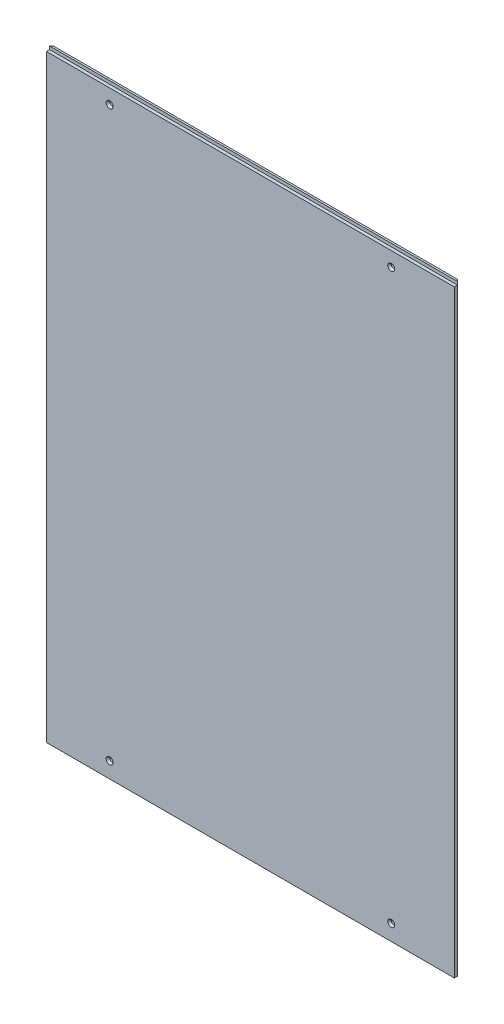
ISO-10303-21;
HEADER;
FILE_DESCRIPTION(('STEP AP214'),'2;1');
FILE_NAME('part.step','',(''),(''),'','','');
FILE_SCHEMA(('AUTOMOTIVE_DESIGN { 1 0 10303 214 1 1 1 1 }'));
ENDSEC;
DATA;
#1=APPLICATION_CONTEXT('core data for automotive mechanical design processes');
#2=APPLICATION_PROTOCOL_DEFINITION('international standard','automotive_design',2000,#1);
#3=PRODUCT_CONTEXT('',#1,'mechanical');
#4=PRODUCT('Part','Part','',(#3));
#5=PRODUCT_RELATED_PRODUCT_CATEGORY('part','',(#4));
#6=PRODUCT_DEFINITION_FORMATION('','',#4);
#7=PRODUCT_DEFINITION_CONTEXT('part definition',#1,'design');
#8=PRODUCT_DEFINITION('design','',#6,#7);
#9=PRODUCT_DEFINITION_SHAPE('','',#8);
#10=(LENGTH_UNIT() NAMED_UNIT(*) SI_UNIT(.MILLI.,.METRE.));
#11=(NAMED_UNIT(*) PLANE_ANGLE_UNIT() SI_UNIT($,.RADIAN.));
#12=(NAMED_UNIT(*) SI_UNIT($,.STERADIAN.) SOLID_ANGLE_UNIT());
#13=UNCERTAINTY_MEASURE_WITH_UNIT(LENGTH_MEASURE(1.E-05),#10,'distance_accuracy_value','');
#14=(GEOMETRIC_REPRESENTATION_CONTEXT(3) GLOBAL_UNCERTAINTY_ASSIGNED_CONTEXT((#13)) GLOBAL_UNIT_ASSIGNED_CONTEXT((#10,
#11,#12)) REPRESENTATION_CONTEXT('',''));
#15=CARTESIAN_POINT('',(0.,0.,0.));
#16=DIRECTION('',(0.,0.,1.));
#17=DIRECTION('',(1.,0.,0.));
#18=AXIS2_PLACEMENT_3D('',#15,#16,#17);
#19=CARTESIAN_POINT('',(-323.,476.5,8.));
#20=DIRECTION('',(0.,-1.,0.));
#21=DIRECTION('',(0.,0.,-1.));
#22=AXIS2_PLACEMENT_3D('',#19,#20,#21);
#23=PLANE('',#22);
#24=DIRECTION('',(-1.,0.,0.));
#25=VECTOR('',#24,1.);
#26=CARTESIAN_POINT('',(323.,476.5,3.));
#27=LINE('',#26,#25);
#28=CARTESIAN_POINT('',(323.,476.5,3.));
#29=VERTEX_POINT('',#28);
#30=CARTESIAN_POINT('',(-323.,476.5,3.));
#31=VERTEX_POINT('',#30);
#32=EDGE_CURVE('E107',#29,#31,#27,.T.);
#33=ORIENTED_EDGE('',*,*,#32,.F.);
#34=DIRECTION('',(-0.707106781186548,0.,-0.707106781186548));
#35=VECTOR('',#34,1.);
#36=CARTESIAN_POINT('',(323.,476.5,2.99999999999989));
#37=LINE('',#36,#35);
#38=CARTESIAN_POINT('',(320.,476.5,0.));
#39=VERTEX_POINT('',#38);
#40=EDGE_CURVE('E135',#29,#39,#37,.T.);
#41=ORIENTED_EDGE('',*,*,#40,.T.);
#42=DIRECTION('',(-1.,0.,0.));
#43=VECTOR('',#42,1.);
#44=CARTESIAN_POINT('',(-323.,476.5,0.));
#45=LINE('',#44,#43);
#46=CARTESIAN_POINT('',(-320.,476.5,0.));
#47=VERTEX_POINT('',#46);
#48=EDGE_CURVE('E221',#39,#47,#45,.T.);
#49=ORIENTED_EDGE('',*,*,#48,.T.);
#50=DIRECTION('',(-0.707106781186548,0.,0.707106781186548));
#51=VECTOR('',#50,1.);
#52=CARTESIAN_POINT('',(-323.,476.5,2.99999999999989));
#53=LINE('',#52,#51);
#54=EDGE_CURVE('E137',#47,#31,#53,.T.);
#55=ORIENTED_EDGE('',*,*,#54,.T.);
#56=EDGE_LOOP('',(#33,#41,#49,#55));
#57=FACE_BOUND('',#56,.T.);
#58=ADVANCED_FACE('F34',(#57),#23,.F.);
#59=CARTESIAN_POINT('',(323.,-476.5,8.));
#60=DIRECTION('',(-1.,0.,0.));
#61=DIRECTION('',(0.,0.,1.));
#62=AXIS2_PLACEMENT_3D('',#59,#60,#61);
#63=PLANE('',#62);
#64=DIRECTION('',(0.,1.,0.));
#65=VECTOR('',#64,1.);
#66=CARTESIAN_POINT('',(323.,476.5,2.99999999999989));
#67=LINE('',#66,#65);
#68=CARTESIAN_POINT('',(323.,-476.5,2.99999999999989));
#69=VERTEX_POINT('',#68);
#70=CARTESIAN_POINT('',(323.,471.5,2.99999999999989));
#71=VERTEX_POINT('',#70);
#72=EDGE_CURVE('E139',#69,#71,#67,.T.);
#73=ORIENTED_EDGE('',*,*,#72,.T.);
#74=DIRECTION('',(0.,0.,1.));
#75=VECTOR('',#74,1.);
#76=CARTESIAN_POINT('',(323.,471.5,3.));
#77=LINE('',#76,#75);
#78=CARTESIAN_POINT('',(323.,471.5,8.));
#79=VERTEX_POINT('',#78);
#80=EDGE_CURVE('E98',#71,#79,#77,.T.);
#81=ORIENTED_EDGE('',*,*,#80,.T.);
#82=DIRECTION('',(0.,1.,0.));
#83=VECTOR('',#82,1.);
#84=CARTESIAN_POINT('',(323.,-476.5,8.));
#85=LINE('',#84,#83);
#86=CARTESIAN_POINT('',(323.,-476.5,8.));
#87=VERTEX_POINT('',#86);
#88=EDGE_CURVE('E228',#87,#79,#85,.T.);
#89=ORIENTED_EDGE('',*,*,#88,.F.);
#90=DIRECTION('',(0.,0.,-1.));
#91=VECTOR('',#90,1.);
#92=CARTESIAN_POINT('',(323.,-476.5,8.));
#93=LINE('',#92,#91);
#94=EDGE_CURVE('E126',#87,#69,#93,.T.);
#95=ORIENTED_EDGE('',*,*,#94,.T.);
#96=EDGE_LOOP('',(#73,#81,#89,#95));
#97=FACE_BOUND('',#96,.T.);
#98=ADVANCED_FACE('F179',(#97),#63,.F.);
#99=CARTESIAN_POINT('',(-323.,-476.5,8.));
#100=DIRECTION('',(1.,0.,0.));
#101=DIRECTION('',(0.,0.,-1.));
#102=AXIS2_PLACEMENT_3D('',#99,#100,#101);
#103=PLANE('',#102);
#104=DIRECTION('',(0.,-1.,0.));
#105=VECTOR('',#104,1.);
#106=CARTESIAN_POINT('',(-323.,-476.5,8.));
#107=LINE('',#106,#105);
#108=CARTESIAN_POINT('',(-323.,471.5,8.));
#109=VERTEX_POINT('',#108);
#110=CARTESIAN_POINT('',(-323.,-476.5,8.));
#111=VERTEX_POINT('',#110);
#112=EDGE_CURVE('E120',#109,#111,#107,.T.);
#113=ORIENTED_EDGE('',*,*,#112,.F.);
#114=DIRECTION('',(0.,0.,1.));
#115=VECTOR('',#114,1.);
#116=CARTESIAN_POINT('',(-323.,471.5,3.));
#117=LINE('',#116,#115);
#118=CARTESIAN_POINT('',(-323.,471.5,3.));
#119=VERTEX_POINT('',#118);
#120=EDGE_CURVE('E95',#119,#109,#117,.T.);
#121=ORIENTED_EDGE('',*,*,#120,.F.);
#122=DIRECTION('',(0.,-1.,0.));
#123=VECTOR('',#122,1.);
#124=CARTESIAN_POINT('',(-323.,-476.5,2.99999999999989));
#125=LINE('',#124,#123);
#126=CARTESIAN_POINT('',(-323.,-476.5,2.99999999999989));
#127=VERTEX_POINT('',#126);
#128=EDGE_CURVE('E113',#119,#127,#125,.T.);
#129=ORIENTED_EDGE('',*,*,#128,.T.);
#130=DIRECTION('',(0.,0.,-1.));
#131=VECTOR('',#130,1.);
#132=CARTESIAN_POINT('',(-323.,-476.5,8.));
#133=LINE('',#132,#131);
#134=EDGE_CURVE('E125',#111,#127,#133,.T.);
#135=ORIENTED_EDGE('',*,*,#134,.F.);
#136=EDGE_LOOP('',(#113,#121,#129,#135));
#137=FACE_BOUND('',#136,.T.);
#138=ADVANCED_FACE('F117',(#137),#103,.F.);
#139=CARTESIAN_POINT('',(-323.,-476.5,8.));
#140=DIRECTION('',(0.,1.,0.));
#141=DIRECTION('',(0.,0.,1.));
#142=AXIS2_PLACEMENT_3D('',#139,#140,#141);
#143=PLANE('',#142);
#144=ORIENTED_EDGE('',*,*,#134,.T.);
#145=DIRECTION('',(0.707106781186548,0.,-0.707106781186548));
#146=VECTOR('',#145,1.);
#147=CARTESIAN_POINT('',(-323.,-476.5,2.99999999999989));
#148=LINE('',#147,#146);
#149=CARTESIAN_POINT('',(-320.,-476.5,0.));
#150=VERTEX_POINT('',#149);
#151=EDGE_CURVE('E123',#127,#150,#148,.T.);
#152=ORIENTED_EDGE('',*,*,#151,.T.);
#153=DIRECTION('',(1.,0.,0.));
#154=VECTOR('',#153,1.);
#155=CARTESIAN_POINT('',(-323.,-476.5,0.));
#156=LINE('',#155,#154);
#157=CARTESIAN_POINT('',(320.,-476.5,0.));
#158=VERTEX_POINT('',#157);
#159=EDGE_CURVE('E231',#150,#158,#156,.T.);
#160=ORIENTED_EDGE('',*,*,#159,.T.);
#161=DIRECTION('',(0.707106781186548,0.,0.707106781186548));
#162=VECTOR('',#161,1.);
#163=CARTESIAN_POINT('',(323.,-476.5,2.99999999999989));
#164=LINE('',#163,#162);
#165=EDGE_CURVE('E112',#158,#69,#164,.T.);
#166=ORIENTED_EDGE('',*,*,#165,.T.);
#167=ORIENTED_EDGE('',*,*,#94,.F.);
#168=DIRECTION('',(1.,0.,0.));
#169=VECTOR('',#168,1.);
#170=CARTESIAN_POINT('',(-323.,-476.5,8.));
#171=LINE('',#170,#169);
#172=EDGE_CURVE('E233',#111,#87,#171,.T.);
#173=ORIENTED_EDGE('',*,*,#172,.F.);
#174=EDGE_LOOP('',(#144,#152,#160,#166,#167,#173));
#175=FACE_BOUND('',#174,.T.);
#176=ADVANCED_FACE('F260',(#175),#143,.F.);
#177=CARTESIAN_POINT('',(0.,0.,8.));
#178=DIRECTION('',(0.,0.,-1.));
#179=DIRECTION('',(-1.,0.,0.));
#180=AXIS2_PLACEMENT_3D('',#177,#178,#179);
#181=PLANE('',#180);
#182=CARTESIAN_POINT('',(-223.,-451.5,8.));
#183=DIRECTION('',(0.,0.,-1.));
#184=DIRECTION('',(-1.,0.,0.));
#185=AXIS2_PLACEMENT_3D('',#182,#183,#184);
#186=CIRCLE('',#185,5.50000000000017);
#187=CARTESIAN_POINT('',(-228.5,-451.5,8.));
#188=VERTEX_POINT('',#187);
#189=EDGE_CURVE('E154',#188,#188,#186,.T.);
#190=ORIENTED_EDGE('',*,*,#189,.T.);
#191=EDGE_LOOP('',(#190));
#192=FACE_BOUND('',#191,.T.);
#193=CARTESIAN_POINT('',(223.,-451.5,8.));
#194=DIRECTION('',(0.,0.,-1.));
#195=DIRECTION('',(-1.,0.,0.));
#196=AXIS2_PLACEMENT_3D('',#193,#194,#195);
#197=CIRCLE('',#196,5.50000000000017);
#198=CARTESIAN_POINT('',(217.5,-451.5,8.));
#199=VERTEX_POINT('',#198);
#200=EDGE_CURVE('E151',#199,#199,#197,.T.);
#201=ORIENTED_EDGE('',*,*,#200,.T.);
#202=EDGE_LOOP('',(#201));
#203=FACE_BOUND('',#202,.T.);
#204=CARTESIAN_POINT('',(223.,448.5,8.));
#205=DIRECTION('',(0.,0.,-1.));
#206=DIRECTION('',(-1.,0.,0.));
#207=AXIS2_PLACEMENT_3D('',#204,#205,#206);
#208=CIRCLE('',#207,5.50000000000017);
#209=CARTESIAN_POINT('',(217.5,448.5,8.));
#210=VERTEX_POINT('',#209);
#211=EDGE_CURVE('E148',#210,#210,#208,.T.);
#212=ORIENTED_EDGE('',*,*,#211,.T.);
#213=EDGE_LOOP('',(#212));
#214=FACE_BOUND('',#213,.T.);
#215=CARTESIAN_POINT('',(-223.,448.5,8.));
#216=DIRECTION('',(0.,0.,-1.));
#217=DIRECTION('',(-1.,0.,0.));
#218=AXIS2_PLACEMENT_3D('',#215,#216,#217);
#219=CIRCLE('',#218,5.50000000000017);
#220=CARTESIAN_POINT('',(-228.5,448.5,8.));
#221=VERTEX_POINT('',#220);
#222=EDGE_CURVE('E145',#221,#221,#219,.T.);
#223=ORIENTED_EDGE('',*,*,#222,.T.);
#224=EDGE_LOOP('',(#223));
#225=FACE_BOUND('',#224,.T.);
#226=ORIENTED_EDGE('',*,*,#88,.T.);
#227=DIRECTION('',(1.,0.,0.));
#228=VECTOR('',#227,1.);
#229=CARTESIAN_POINT('',(-323.,471.5,8.));
#230=LINE('',#229,#228);
#231=EDGE_CURVE('E101',#109,#79,#230,.T.);
#232=ORIENTED_EDGE('',*,*,#231,.F.);
#233=ORIENTED_EDGE('',*,*,#112,.T.);
#234=ORIENTED_EDGE('',*,*,#172,.T.);
#235=EDGE_LOOP('',(#226,#232,#233,#234));
#236=FACE_BOUND('',#235,.T.);
#237=ADVANCED_FACE('F255',(#192,#203,#214,#225,#236),#181,.F.);
#238=CARTESIAN_POINT('',(0.,0.,0.));
#239=DIRECTION('',(0.,0.,-1.));
#240=DIRECTION('',(-1.,0.,0.));
#241=AXIS2_PLACEMENT_3D('',#238,#239,#240);
#242=PLANE('',#241);
#243=CARTESIAN_POINT('',(223.,448.5,0.));
#244=DIRECTION('',(0.,0.,1.));
#245=DIRECTION('',(1.,0.,0.));
#246=AXIS2_PLACEMENT_3D('',#243,#244,#245);
#247=CIRCLE('',#246,2.50000000000002);
#248=CARTESIAN_POINT('',(225.5,448.5,0.));
#249=VERTEX_POINT('',#248);
#250=EDGE_CURVE('E224',#249,#249,#247,.T.);
#251=ORIENTED_EDGE('',*,*,#250,.T.);
#252=EDGE_LOOP('',(#251));
#253=FACE_BOUND('',#252,.T.);
#254=CARTESIAN_POINT('',(223.,-451.5,0.));
#255=DIRECTION('',(0.,0.,1.));
#256=DIRECTION('',(1.,0.,0.));
#257=AXIS2_PLACEMENT_3D('',#254,#255,#256);
#258=CIRCLE('',#257,2.50000000000002);
#259=CARTESIAN_POINT('',(225.5,-451.5,0.));
#260=VERTEX_POINT('',#259);
#261=EDGE_CURVE('E218',#260,#260,#258,.T.);
#262=ORIENTED_EDGE('',*,*,#261,.T.);
#263=EDGE_LOOP('',(#262));
#264=FACE_BOUND('',#263,.T.);
#265=CARTESIAN_POINT('',(-223.,-451.5,0.));
#266=DIRECTION('',(0.,0.,1.));
#267=DIRECTION('',(1.,0.,0.));
#268=AXIS2_PLACEMENT_3D('',#265,#266,#267);
#269=CIRCLE('',#268,2.50000000000002);
#270=CARTESIAN_POINT('',(-220.5,-451.5,0.));
#271=VERTEX_POINT('',#270);
#272=EDGE_CURVE('E215',#271,#271,#269,.T.);
#273=ORIENTED_EDGE('',*,*,#272,.T.);
#274=EDGE_LOOP('',(#273));
#275=FACE_BOUND('',#274,.T.);
#276=CARTESIAN_POINT('',(-223.,448.5,0.));
#277=DIRECTION('',(0.,0.,1.));
#278=DIRECTION('',(1.,0.,0.));
#279=AXIS2_PLACEMENT_3D('',#276,#277,#278);
#280=CIRCLE('',#279,2.50000000000002);
#281=CARTESIAN_POINT('',(-220.5,448.5,0.));
#282=VERTEX_POINT('',#281);
#283=EDGE_CURVE('E217',#282,#282,#280,.T.);
#284=ORIENTED_EDGE('',*,*,#283,.T.);
#285=EDGE_LOOP('',(#284));
#286=FACE_BOUND('',#285,.T.);
#287=ORIENTED_EDGE('',*,*,#159,.F.);
#288=DIRECTION('',(0.,1.,0.));
#289=VECTOR('',#288,1.);
#290=CARTESIAN_POINT('',(-320.,476.5,0.));
#291=LINE('',#290,#289);
#292=EDGE_CURVE('E57',#150,#47,#291,.T.);
#293=ORIENTED_EDGE('',*,*,#292,.T.);
#294=ORIENTED_EDGE('',*,*,#48,.F.);
#295=DIRECTION('',(0.,-1.,0.));
#296=VECTOR('',#295,1.);
#297=CARTESIAN_POINT('',(320.,-476.5,0.));
#298=LINE('',#297,#296);
#299=EDGE_CURVE('E132',#39,#158,#298,.T.);
#300=ORIENTED_EDGE('',*,*,#299,.T.);
#301=EDGE_LOOP('',(#287,#293,#294,#300));
#302=FACE_BOUND('',#301,.T.);
#303=ADVANCED_FACE('F193',(#253,#264,#275,#286,#302),#242,.T.);
#304=CARTESIAN_POINT('',(-323.,-476.5,2.99999999999989));
#305=DIRECTION('',(-0.707106781186547,0.,-0.707106781186547));
#306=DIRECTION('',(0.,1.,0.));
#307=AXIS2_PLACEMENT_3D('',#304,#305,#306);
#308=PLANE('',#307);
#309=ORIENTED_EDGE('',*,*,#54,.F.);
#310=ORIENTED_EDGE('',*,*,#292,.F.);
#311=ORIENTED_EDGE('',*,*,#151,.F.);
#312=ORIENTED_EDGE('',*,*,#128,.F.);
#313=EDGE_CURVE('E104',#31,#119,#125,.T.);
#314=ORIENTED_EDGE('',*,*,#313,.F.);
#315=EDGE_LOOP('',(#309,#310,#311,#312,#314));
#316=FACE_BOUND('',#315,.T.);
#317=ADVANCED_FACE('F122',(#316),#308,.T.);
#318=CARTESIAN_POINT('',(323.,-476.5,2.99999999999989));
#319=DIRECTION('',(0.707106781186547,0.,-0.707106781186547));
#320=DIRECTION('',(0.,-1.,0.));
#321=AXIS2_PLACEMENT_3D('',#318,#319,#320);
#322=PLANE('',#321);
#323=ORIENTED_EDGE('',*,*,#165,.F.);
#324=ORIENTED_EDGE('',*,*,#299,.F.);
#325=ORIENTED_EDGE('',*,*,#40,.F.);
#326=DIRECTION('',(0.,1.,0.));
#327=VECTOR('',#326,1.);
#328=CARTESIAN_POINT('',(323.,471.5,3.));
#329=LINE('',#328,#327);
#330=EDGE_CURVE('E100',#71,#29,#329,.T.);
#331=ORIENTED_EDGE('',*,*,#330,.F.);
#332=ORIENTED_EDGE('',*,*,#72,.F.);
#333=EDGE_LOOP('',(#323,#324,#325,#331,#332));
#334=FACE_BOUND('',#333,.T.);
#335=ADVANCED_FACE('F192',(#334),#322,.T.);
#336=CARTESIAN_POINT('',(-223.,448.5,0.));
#337=DIRECTION('',(0.,0.,1.));
#338=DIRECTION('',(1.,0.,0.));
#339=AXIS2_PLACEMENT_3D('',#336,#337,#338);
#340=CYLINDRICAL_SURFACE('',#339,2.50000000000002);
#341=CARTESIAN_POINT('',(-223.,448.5,4.99999999999984));
#342=DIRECTION('',(0.,0.,-1.));
#343=DIRECTION('',(-1.,0.,0.));
#344=AXIS2_PLACEMENT_3D('',#341,#342,#343);
#345=CIRCLE('',#344,2.50000000000002);
#346=CARTESIAN_POINT('',(-225.5,448.5,4.99999999999984));
#347=VERTEX_POINT('',#346);
#348=EDGE_CURVE('E11',#347,#347,#345,.F.);
#349=ORIENTED_EDGE('',*,*,#348,.T.);
#350=EDGE_LOOP('',(#349));
#351=FACE_BOUND('',#350,.T.);
#352=ORIENTED_EDGE('',*,*,#283,.F.);
#353=EDGE_LOOP('',(#352));
#354=FACE_BOUND('',#353,.T.);
#355=ADVANCED_FACE('F196',(#351,#354),#340,.F.);
#356=CARTESIAN_POINT('',(-223.,-451.5,0.));
#357=DIRECTION('',(0.,0.,1.));
#358=DIRECTION('',(1.,0.,0.));
#359=AXIS2_PLACEMENT_3D('',#356,#357,#358);
#360=CYLINDRICAL_SURFACE('',#359,2.50000000000002);
#361=CARTESIAN_POINT('',(-223.,-451.5,4.99999999999984));
#362=DIRECTION('',(0.,0.,-1.));
#363=DIRECTION('',(-1.,0.,0.));
#364=AXIS2_PLACEMENT_3D('',#361,#362,#363);
#365=CIRCLE('',#364,2.50000000000002);
#366=CARTESIAN_POINT('',(-225.5,-451.5,4.99999999999984));
#367=VERTEX_POINT('',#366);
#368=EDGE_CURVE('E142',#367,#367,#365,.F.);
#369=ORIENTED_EDGE('',*,*,#368,.T.);
#370=EDGE_LOOP('',(#369));
#371=FACE_BOUND('',#370,.T.);
#372=ORIENTED_EDGE('',*,*,#272,.F.);
#373=EDGE_LOOP('',(#372));
#374=FACE_BOUND('',#373,.T.);
#375=ADVANCED_FACE('F209',(#371,#374),#360,.F.);
#376=CARTESIAN_POINT('',(223.,-451.5,0.));
#377=DIRECTION('',(0.,0.,1.));
#378=DIRECTION('',(1.,0.,0.));
#379=AXIS2_PLACEMENT_3D('',#376,#377,#378);
#380=CYLINDRICAL_SURFACE('',#379,2.50000000000002);
#381=CARTESIAN_POINT('',(223.,-451.5,4.99999999999984));
#382=DIRECTION('',(0.,0.,-1.));
#383=DIRECTION('',(-1.,0.,0.));
#384=AXIS2_PLACEMENT_3D('',#381,#382,#383);
#385=CIRCLE('',#384,2.50000000000002);
#386=CARTESIAN_POINT('',(220.5,-451.5,4.99999999999984));
#387=VERTEX_POINT('',#386);
#388=EDGE_CURVE('E157',#387,#387,#385,.F.);
#389=ORIENTED_EDGE('',*,*,#388,.T.);
#390=EDGE_LOOP('',(#389));
#391=FACE_BOUND('',#390,.T.);
#392=ORIENTED_EDGE('',*,*,#261,.F.);
#393=EDGE_LOOP('',(#392));
#394=FACE_BOUND('',#393,.T.);
#395=ADVANCED_FACE('F203',(#391,#394),#380,.F.);
#396=CARTESIAN_POINT('',(223.,448.5,0.));
#397=DIRECTION('',(0.,0.,1.));
#398=DIRECTION('',(1.,0.,0.));
#399=AXIS2_PLACEMENT_3D('',#396,#397,#398);
#400=CYLINDRICAL_SURFACE('',#399,2.50000000000002);
#401=CARTESIAN_POINT('',(223.,448.5,4.99999999999984));
#402=DIRECTION('',(0.,0.,-1.));
#403=DIRECTION('',(-1.,0.,0.));
#404=AXIS2_PLACEMENT_3D('',#401,#402,#403);
#405=CIRCLE('',#404,2.50000000000002);
#406=CARTESIAN_POINT('',(220.5,448.5,4.99999999999984));
#407=VERTEX_POINT('',#406);
#408=EDGE_CURVE('E42',#407,#407,#405,.F.);
#409=ORIENTED_EDGE('',*,*,#408,.T.);
#410=EDGE_LOOP('',(#409));
#411=FACE_BOUND('',#410,.T.);
#412=ORIENTED_EDGE('',*,*,#250,.F.);
#413=EDGE_LOOP('',(#412));
#414=FACE_BOUND('',#413,.T.);
#415=ADVANCED_FACE('F162',(#411,#414),#400,.F.);
#416=CARTESIAN_POINT('',(-223.,-451.5,4.99999999999984));
#417=DIRECTION('',(0.,0.,1.));
#418=DIRECTION('',(1.,0.,0.));
#419=AXIS2_PLACEMENT_3D('',#416,#417,#418);
#420=CONICAL_SURFACE('',#419,2.50000000000002,0.785398163397447);
#421=ORIENTED_EDGE('',*,*,#189,.F.);
#422=EDGE_LOOP('',(#421));
#423=FACE_BOUND('',#422,.T.);
#424=ORIENTED_EDGE('',*,*,#368,.F.);
#425=EDGE_LOOP('',(#424));
#426=FACE_BOUND('',#425,.T.);
#427=ADVANCED_FACE('F174',(#423,#426),#420,.F.);
#428=CARTESIAN_POINT('',(223.,-451.5,4.99999999999984));
#429=DIRECTION('',(0.,0.,1.));
#430=DIRECTION('',(1.,0.,0.));
#431=AXIS2_PLACEMENT_3D('',#428,#429,#430);
#432=CONICAL_SURFACE('',#431,2.50000000000002,0.785398163397447);
#433=ORIENTED_EDGE('',*,*,#200,.F.);
#434=EDGE_LOOP('',(#433));
#435=FACE_BOUND('',#434,.T.);
#436=ORIENTED_EDGE('',*,*,#388,.F.);
#437=EDGE_LOOP('',(#436));
#438=FACE_BOUND('',#437,.T.);
#439=ADVANCED_FACE('F167',(#435,#438),#432,.F.);
#440=CARTESIAN_POINT('',(223.,448.5,4.99999999999984));
#441=DIRECTION('',(0.,0.,1.));
#442=DIRECTION('',(1.,0.,0.));
#443=AXIS2_PLACEMENT_3D('',#440,#441,#442);
#444=CONICAL_SURFACE('',#443,2.50000000000002,0.785398163397447);
#445=ORIENTED_EDGE('',*,*,#211,.F.);
#446=EDGE_LOOP('',(#445));
#447=FACE_BOUND('',#446,.T.);
#448=ORIENTED_EDGE('',*,*,#408,.F.);
#449=EDGE_LOOP('',(#448));
#450=FACE_BOUND('',#449,.T.);
#451=ADVANCED_FACE('F165',(#447,#450),#444,.F.);
#452=CARTESIAN_POINT('',(-223.,448.5,4.99999999999984));
#453=DIRECTION('',(0.,0.,1.));
#454=DIRECTION('',(1.,0.,0.));
#455=AXIS2_PLACEMENT_3D('',#452,#453,#454);
#456=CONICAL_SURFACE('',#455,2.50000000000002,0.785398163397447);
#457=ORIENTED_EDGE('',*,*,#222,.F.);
#458=EDGE_LOOP('',(#457));
#459=FACE_BOUND('',#458,.T.);
#460=ORIENTED_EDGE('',*,*,#348,.F.);
#461=EDGE_LOOP('',(#460));
#462=FACE_BOUND('',#461,.T.);
#463=ADVANCED_FACE('F36',(#459,#462),#456,.F.);
#464=CARTESIAN_POINT('',(-323.,471.5,3.));
#465=DIRECTION('',(0.,-1.,0.));
#466=DIRECTION('',(0.,0.,-1.));
#467=AXIS2_PLACEMENT_3D('',#464,#465,#466);
#468=PLANE('',#467);
#469=ORIENTED_EDGE('',*,*,#231,.T.);
#470=ORIENTED_EDGE('',*,*,#80,.F.);
#471=DIRECTION('',(1.,0.,0.));
#472=VECTOR('',#471,1.);
#473=CARTESIAN_POINT('',(-323.,471.5,3.));
#474=LINE('',#473,#472);
#475=EDGE_CURVE('E49',#119,#71,#474,.T.);
#476=ORIENTED_EDGE('',*,*,#475,.F.);
#477=ORIENTED_EDGE('',*,*,#120,.T.);
#478=EDGE_LOOP('',(#469,#470,#476,#477));
#479=FACE_BOUND('',#478,.T.);
#480=ADVANCED_FACE('F93',(#479),#468,.F.);
#481=CARTESIAN_POINT('',(0.,0.,3.));
#482=DIRECTION('',(0.,0.,1.));
#483=DIRECTION('',(1.,0.,0.));
#484=AXIS2_PLACEMENT_3D('',#481,#482,#483);
#485=PLANE('',#484);
#486=ORIENTED_EDGE('',*,*,#313,.T.);
#487=ORIENTED_EDGE('',*,*,#475,.T.);
#488=ORIENTED_EDGE('',*,*,#330,.T.);
#489=ORIENTED_EDGE('',*,*,#32,.T.);
#490=EDGE_LOOP('',(#486,#487,#488,#489));
#491=FACE_BOUND('',#490,.T.);
#492=ADVANCED_FACE('F105',(#491),#485,.T.);
#493=CLOSED_SHELL('',(#58,#98,#138,#176,#237,#303,#317,#335,#355,#375,#395,#415,#427,#439,#451,
#463,#480,#492));
#494=MANIFOLD_SOLID_BREP('B2',#493);
#495=ADVANCED_BREP_SHAPE_REPRESENTATION('',(#18,#494),#14);
#496=SHAPE_DEFINITION_REPRESENTATION(#9,#495);
ENDSEC;
END-ISO-10303-21;
